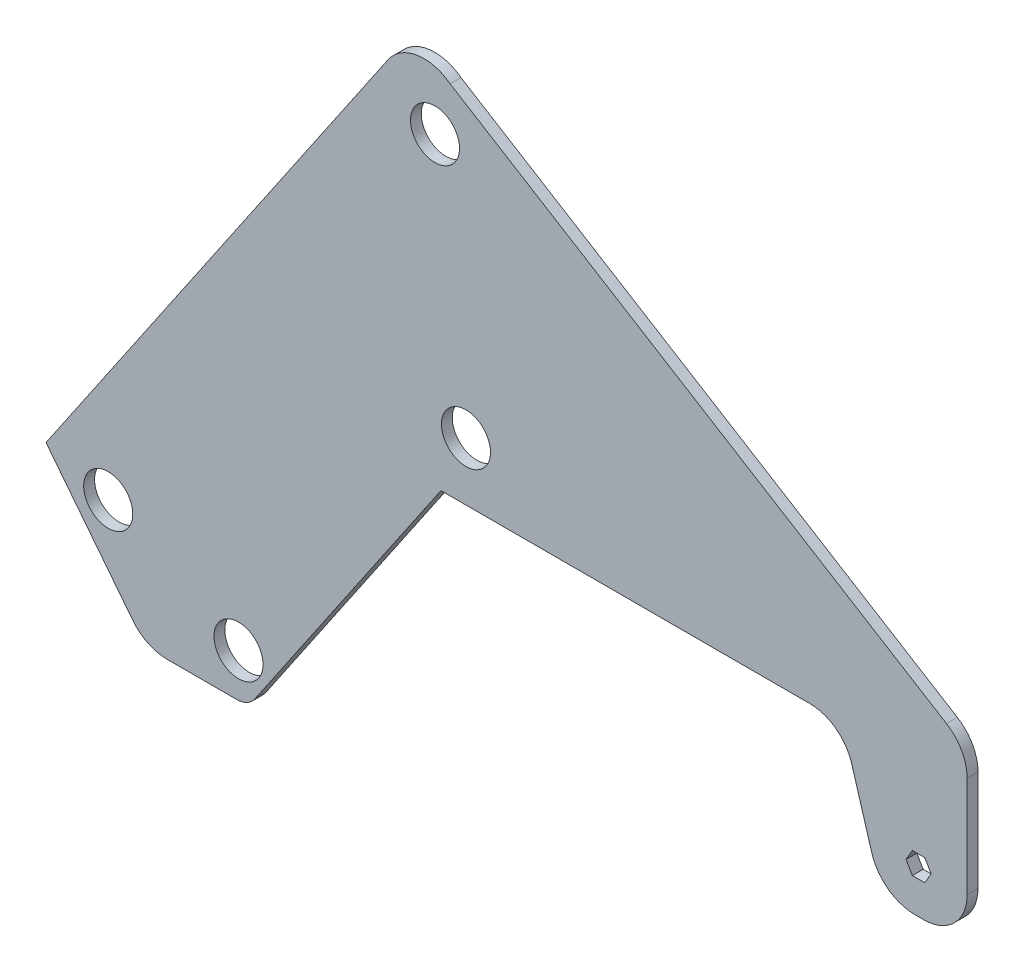
ISO-10303-21;
HEADER;
FILE_DESCRIPTION(('STEP AP214'),'2;1');
FILE_NAME('part.step','',(''),(''),'','','');
FILE_SCHEMA(('AUTOMOTIVE_DESIGN { 1 0 10303 214 1 1 1 1 }'));
ENDSEC;
DATA;
#1=APPLICATION_CONTEXT('core data for automotive mechanical design processes');
#2=APPLICATION_PROTOCOL_DEFINITION('international standard','automotive_design',2000,#1);
#3=PRODUCT_CONTEXT('',#1,'mechanical');
#4=PRODUCT('Part','Part','',(#3));
#5=PRODUCT_RELATED_PRODUCT_CATEGORY('part','',(#4));
#6=PRODUCT_DEFINITION_FORMATION('','',#4);
#7=PRODUCT_DEFINITION_CONTEXT('part definition',#1,'design');
#8=PRODUCT_DEFINITION('design','',#6,#7);
#9=PRODUCT_DEFINITION_SHAPE('','',#8);
#10=(LENGTH_UNIT() NAMED_UNIT(*) SI_UNIT(.MILLI.,.METRE.));
#11=(NAMED_UNIT(*) PLANE_ANGLE_UNIT() SI_UNIT($,.RADIAN.));
#12=(NAMED_UNIT(*) SI_UNIT($,.STERADIAN.) SOLID_ANGLE_UNIT());
#13=UNCERTAINTY_MEASURE_WITH_UNIT(LENGTH_MEASURE(1.E-05),#10,'distance_accuracy_value','');
#14=(GEOMETRIC_REPRESENTATION_CONTEXT(3) GLOBAL_UNCERTAINTY_ASSIGNED_CONTEXT((#13)) GLOBAL_UNIT_ASSIGNED_CONTEXT((#10,
#11,#12)) REPRESENTATION_CONTEXT('',''));
#15=CARTESIAN_POINT('',(0.,0.,0.));
#16=DIRECTION('',(0.,0.,1.));
#17=DIRECTION('',(1.,0.,0.));
#18=AXIS2_PLACEMENT_3D('',#15,#16,#17);
#19=CARTESIAN_POINT('',(102.472108534572,0.,6.35));
#20=DIRECTION('',(-1.,0.,0.));
#21=DIRECTION('',(0.,-1.,0.));
#22=AXIS2_PLACEMENT_3D('',#19,#20,#21);
#23=PLANE('',#22);
#24=DIRECTION('',(0.,1.,0.));
#25=VECTOR('',#24,1.);
#26=CARTESIAN_POINT('',(102.472108534572,0.,0.));
#27=LINE('',#26,#25);
#28=CARTESIAN_POINT('',(102.472108534572,53.8502480160104,0.));
#29=VERTEX_POINT('',#28);
#30=CARTESIAN_POINT('',(102.472108534572,112.853785651262,0.));
#31=VERTEX_POINT('',#30);
#32=EDGE_CURVE('E248',#29,#31,#27,.T.);
#33=ORIENTED_EDGE('',*,*,#32,.T.);
#34=DIRECTION('',(0.,0.,-1.));
#35=VECTOR('',#34,1.);
#36=CARTESIAN_POINT('',(102.472108534572,112.853785651262,6.35));
#37=LINE('',#36,#35);
#38=CARTESIAN_POINT('',(102.472108534572,112.853785651262,6.35));
#39=VERTEX_POINT('',#38);
#40=EDGE_CURVE('E11',#39,#31,#37,.T.);
#41=ORIENTED_EDGE('',*,*,#40,.F.);
#42=DIRECTION('',(0.,1.,0.));
#43=VECTOR('',#42,1.);
#44=CARTESIAN_POINT('',(102.472108534572,0.,6.35));
#45=LINE('',#44,#43);
#46=CARTESIAN_POINT('',(102.472108534572,53.8502480160104,6.35));
#47=VERTEX_POINT('',#46);
#48=EDGE_CURVE('E370',#47,#39,#45,.T.);
#49=ORIENTED_EDGE('',*,*,#48,.F.);
#50=DIRECTION('',(0.,0.,-1.));
#51=VECTOR('',#50,1.);
#52=CARTESIAN_POINT('',(102.472108534572,53.8502480160104,6.35));
#53=LINE('',#52,#51);
#54=EDGE_CURVE('E286',#47,#29,#53,.T.);
#55=ORIENTED_EDGE('',*,*,#54,.T.);
#56=EDGE_LOOP('',(#33,#41,#49,#55));
#57=FACE_BOUND('',#56,.T.);
#58=ADVANCED_FACE('F34',(#57),#23,.F.);
#59=CARTESIAN_POINT('',(77.0721085345722,112.853785651262,6.35));
#60=DIRECTION('',(0.,0.,-1.));
#61=DIRECTION('',(-1.,0.,0.));
#62=AXIS2_PLACEMENT_3D('',#59,#60,#61);
#63=CYLINDRICAL_SURFACE('',#62,25.4);
#64=CARTESIAN_POINT('',(77.0721085345722,112.853785651262,0.));
#65=DIRECTION('',(0.,0.,1.));
#66=DIRECTION('',(1.,0.,0.));
#67=AXIS2_PLACEMENT_3D('',#64,#65,#66);
#68=CIRCLE('',#67,25.4);
#69=CARTESIAN_POINT('',(90.396972478243,134.478031323254,0.));
#70=VERTEX_POINT('',#69);
#71=EDGE_CURVE('E251',#31,#70,#68,.T.);
#72=ORIENTED_EDGE('',*,*,#71,.T.);
#73=DIRECTION('',(0.,0.,-1.));
#74=VECTOR('',#73,1.);
#75=CARTESIAN_POINT('',(90.396972478243,134.478031323254,6.35));
#76=LINE('',#75,#74);
#77=CARTESIAN_POINT('',(90.396972478243,134.478031323254,6.35));
#78=VERTEX_POINT('',#77);
#79=EDGE_CURVE('E44',#78,#70,#76,.T.);
#80=ORIENTED_EDGE('',*,*,#79,.F.);
#81=CARTESIAN_POINT('',(77.0721085345722,112.853785651262,6.35));
#82=DIRECTION('',(0.,0.,1.));
#83=DIRECTION('',(1.,0.,0.));
#84=AXIS2_PLACEMENT_3D('',#81,#82,#83);
#85=CIRCLE('',#84,25.4);
#86=EDGE_CURVE('E372',#39,#78,#85,.T.);
#87=ORIENTED_EDGE('',*,*,#86,.F.);
#88=ORIENTED_EDGE('',*,*,#40,.T.);
#89=EDGE_LOOP('',(#72,#80,#87,#88));
#90=FACE_BOUND('',#89,.T.);
#91=ADVANCED_FACE('F421',(#90),#63,.T.);
#92=CARTESIAN_POINT('',(84.9381251195718,137.841774014995,6.35));
#93=DIRECTION('',(-0.524600942664203,-0.851348254802833,0.));
#94=DIRECTION('',(0.851348254802833,-0.524600942664203,0.));
#95=AXIS2_PLACEMENT_3D('',#92,#93,#94);
#96=PLANE('',#95);
#97=DIRECTION('',(-0.851348254802833,0.524600942664203,0.));
#98=VECTOR('',#97,1.);
#99=CARTESIAN_POINT('',(84.9381251195718,137.841774014995,0.));
#100=LINE('',#99,#98);
#101=CARTESIAN_POINT('',(-199.949582692955,313.389629112798,0.));
#102=VERTEX_POINT('',#101);
#103=EDGE_CURVE('E253',#70,#102,#100,.T.);
#104=ORIENTED_EDGE('',*,*,#103,.T.);
#105=DIRECTION('',(0.,0.,-1.));
#106=VECTOR('',#105,1.);
#107=CARTESIAN_POINT('',(-199.949582692955,313.389629112798,6.35));
#108=LINE('',#107,#106);
#109=CARTESIAN_POINT('',(-199.949582692955,313.389629112798,6.35));
#110=VERTEX_POINT('',#109);
#111=EDGE_CURVE('E312',#110,#102,#108,.T.);
#112=ORIENTED_EDGE('',*,*,#111,.F.);
#113=DIRECTION('',(-0.851348254802833,0.524600942664203,0.));
#114=VECTOR('',#113,1.);
#115=CARTESIAN_POINT('',(84.9381251195718,137.841774014995,6.35));
#116=LINE('',#115,#114);
#117=EDGE_CURVE('E374',#78,#110,#116,.T.);
#118=ORIENTED_EDGE('',*,*,#117,.F.);
#119=ORIENTED_EDGE('',*,*,#79,.T.);
#120=EDGE_LOOP('',(#104,#112,#118,#119));
#121=FACE_BOUND('',#120,.T.);
#122=ADVANCED_FACE('F426',(#121),#96,.F.);
#123=CARTESIAN_POINT('',(-215.304985157272,293.156695189146,6.35));
#124=DIRECTION('',(0.,0.,-1.));
#125=DIRECTION('',(-1.,0.,0.));
#126=AXIS2_PLACEMENT_3D('',#123,#124,#125);
#127=CYLINDRICAL_SURFACE('',#126,25.4);
#128=CARTESIAN_POINT('',(-215.304985157272,293.156695189146,0.));
#129=DIRECTION('',(0.,0.,1.));
#130=DIRECTION('',(1.,0.,0.));
#131=AXIS2_PLACEMENT_3D('',#128,#129,#130);
#132=CIRCLE('',#131,25.4);
#133=CARTESIAN_POINT('',(-236.303247901058,307.447705011511,0.));
#134=VERTEX_POINT('',#133);
#135=EDGE_CURVE('E256',#134,#102,#132,.F.);
#136=ORIENTED_EDGE('',*,*,#135,.F.);
#137=DIRECTION('',(0.,0.,-1.));
#138=VECTOR('',#137,1.);
#139=CARTESIAN_POINT('',(-236.303247901058,307.447705011511,6.35));
#140=LINE('',#139,#138);
#141=CARTESIAN_POINT('',(-236.303247901058,307.447705011511,6.35));
#142=VERTEX_POINT('',#141);
#143=EDGE_CURVE('E310',#142,#134,#140,.T.);
#144=ORIENTED_EDGE('',*,*,#143,.F.);
#145=CARTESIAN_POINT('',(-215.304985157272,293.156695189146,6.35));
#146=DIRECTION('',(0.,0.,1.));
#147=DIRECTION('',(1.,0.,0.));
#148=AXIS2_PLACEMENT_3D('',#145,#146,#147);
#149=CIRCLE('',#148,25.4);
#150=EDGE_CURVE('E376',#142,#110,#149,.F.);
#151=ORIENTED_EDGE('',*,*,#150,.T.);
#152=ORIENTED_EDGE('',*,*,#111,.T.);
#153=EDGE_LOOP('',(#136,#144,#151,#152));
#154=FACE_BOUND('',#153,.T.);
#155=ADVANCED_FACE('F498',(#154),#127,.T.);
#156=CARTESIAN_POINT('',(-304.503316688019,207.239043668924,6.35));
#157=DIRECTION('',(0.82670325762938,-0.562638181982854,0.));
#158=DIRECTION('',(0.562638181982854,0.82670325762938,0.));
#159=AXIS2_PLACEMENT_3D('',#156,#157,#158);
#160=PLANE('',#159);
#161=DIRECTION('',(-0.562638181982854,-0.82670325762938,0.));
#162=VECTOR('',#161,1.);
#163=CARTESIAN_POINT('',(-304.503316688019,207.239043668924,0.));
#164=LINE('',#163,#162);
#165=CARTESIAN_POINT('',(-436.377385414161,13.4720265985031,0.));
#166=VERTEX_POINT('',#165);
#167=EDGE_CURVE('E259',#134,#166,#164,.T.);
#168=ORIENTED_EDGE('',*,*,#167,.T.);
#169=DIRECTION('',(0.,0.,-1.));
#170=VECTOR('',#169,1.);
#171=CARTESIAN_POINT('',(-436.377385414161,13.4720265985031,6.35));
#172=LINE('',#171,#170);
#173=CARTESIAN_POINT('',(-436.377385414161,13.4720265985031,6.35));
#174=VERTEX_POINT('',#173);
#175=EDGE_CURVE('E307',#174,#166,#172,.T.);
#176=ORIENTED_EDGE('',*,*,#175,.F.);
#177=DIRECTION('',(-0.562638181982854,-0.82670325762938,0.));
#178=VECTOR('',#177,1.);
#179=CARTESIAN_POINT('',(-304.503316688019,207.239043668924,6.35));
#180=LINE('',#179,#178);
#181=EDGE_CURVE('E379',#142,#174,#180,.T.);
#182=ORIENTED_EDGE('',*,*,#181,.F.);
#183=ORIENTED_EDGE('',*,*,#143,.T.);
#184=EDGE_LOOP('',(#168,#176,#182,#183));
#185=FACE_BOUND('',#184,.T.);
#186=ADVANCED_FACE('F494',(#185),#160,.F.);
#187=CARTESIAN_POINT('',(-263.347672168998,-206.83445768012,6.35));
#188=DIRECTION('',(0.786436663589847,0.617670927081459,0.));
#189=DIRECTION('',(-0.617670927081459,0.786436663589847,0.));
#190=AXIS2_PLACEMENT_3D('',#187,#188,#189);
#191=PLANE('',#190);
#192=DIRECTION('',(0.617670927081459,-0.786436663589847,0.));
#193=VECTOR('',#192,1.);
#194=CARTESIAN_POINT('',(-263.347672168998,-206.83445768012,0.));
#195=LINE('',#194,#193);
#196=CARTESIAN_POINT('',(-385.58146606046,-51.2028214298151,0.));
#197=VERTEX_POINT('',#196);
#198=EDGE_CURVE('E261',#166,#197,#195,.T.);
#199=ORIENTED_EDGE('',*,*,#198,.T.);
#200=DIRECTION('',(0.,0.,-1.));
#201=VECTOR('',#200,1.);
#202=CARTESIAN_POINT('',(-385.58146606046,-51.2028214298151,6.35));
#203=LINE('',#202,#201);
#204=CARTESIAN_POINT('',(-385.58146606046,-51.2028214298151,6.35));
#205=VERTEX_POINT('',#204);
#206=EDGE_CURVE('E305',#205,#197,#203,.T.);
#207=ORIENTED_EDGE('',*,*,#206,.F.);
#208=DIRECTION('',(0.617670927081459,-0.786436663589847,0.));
#209=VECTOR('',#208,1.);
#210=CARTESIAN_POINT('',(-263.347672168998,-206.83445768012,6.35));
#211=LINE('',#210,#209);
#212=EDGE_CURVE('E381',#174,#205,#211,.T.);
#213=ORIENTED_EDGE('',*,*,#212,.F.);
#214=ORIENTED_EDGE('',*,*,#175,.T.);
#215=EDGE_LOOP('',(#199,#207,#213,#214));
#216=FACE_BOUND('',#215,.T.);
#217=ADVANCED_FACE('F490',(#216),#191,.F.);
#218=CARTESIAN_POINT('',(-365.605974805278,-35.513979881946,6.35));
#219=DIRECTION('',(0.,0.,-1.));
#220=DIRECTION('',(-1.,0.,0.));
#221=AXIS2_PLACEMENT_3D('',#218,#219,#220);
#222=CYLINDRICAL_SURFACE('',#221,25.3999999999999);
#223=CARTESIAN_POINT('',(-365.605974805278,-35.513979881946,0.));
#224=DIRECTION('',(0.,0.,1.));
#225=DIRECTION('',(1.,0.,0.));
#226=AXIS2_PLACEMENT_3D('',#223,#224,#225);
#227=CIRCLE('',#226,25.3999999999999);
#228=CARTESIAN_POINT('',(-365.605974805278,-60.913979881946,0.));
#229=VERTEX_POINT('',#228);
#230=EDGE_CURVE('E264',#229,#197,#227,.F.);
#231=ORIENTED_EDGE('',*,*,#230,.F.);
#232=DIRECTION('',(0.,0.,-1.));
#233=VECTOR('',#232,1.);
#234=CARTESIAN_POINT('',(-365.605974805278,-60.913979881946,6.35));
#235=LINE('',#234,#233);
#236=CARTESIAN_POINT('',(-365.605974805278,-60.913979881946,6.35));
#237=VERTEX_POINT('',#236);
#238=EDGE_CURVE('E303',#237,#229,#235,.T.);
#239=ORIENTED_EDGE('',*,*,#238,.F.);
#240=CARTESIAN_POINT('',(-365.605974805278,-35.513979881946,6.35));
#241=DIRECTION('',(0.,0.,1.));
#242=DIRECTION('',(1.,0.,0.));
#243=AXIS2_PLACEMENT_3D('',#240,#241,#242);
#244=CIRCLE('',#243,25.3999999999999);
#245=EDGE_CURVE('E383',#237,#205,#244,.F.);
#246=ORIENTED_EDGE('',*,*,#245,.T.);
#247=ORIENTED_EDGE('',*,*,#206,.T.);
#248=EDGE_LOOP('',(#231,#239,#246,#247));
#249=FACE_BOUND('',#248,.T.);
#250=ADVANCED_FACE('F486',(#249),#222,.T.);
#251=CARTESIAN_POINT('',(0.,-60.913979881946,6.35));
#252=DIRECTION('',(0.,1.,0.));
#253=DIRECTION('',(0.,0.,1.));
#254=AXIS2_PLACEMENT_3D('',#251,#252,#253);
#255=PLANE('',#254);
#256=DIRECTION('',(1.,0.,0.));
#257=VECTOR('',#256,1.);
#258=CARTESIAN_POINT('',(0.,-60.913979881946,0.));
#259=LINE('',#258,#257);
#260=CARTESIAN_POINT('',(-324.737451002008,-60.913979881946,0.));
#261=VERTEX_POINT('',#260);
#262=EDGE_CURVE('E267',#229,#261,#259,.T.);
#263=ORIENTED_EDGE('',*,*,#262,.T.);
#264=DIRECTION('',(0.,0.,-1.));
#265=VECTOR('',#264,1.);
#266=CARTESIAN_POINT('',(-324.737451002008,-60.913979881946,6.35));
#267=LINE('',#266,#265);
#268=CARTESIAN_POINT('',(-324.737451002008,-60.913979881946,6.35));
#269=VERTEX_POINT('',#268);
#270=EDGE_CURVE('E300',#269,#261,#267,.T.);
#271=ORIENTED_EDGE('',*,*,#270,.F.);
#272=DIRECTION('',(1.,0.,0.));
#273=VECTOR('',#272,1.);
#274=CARTESIAN_POINT('',(0.,-60.913979881946,6.35));
#275=LINE('',#274,#273);
#276=EDGE_CURVE('E386',#237,#269,#275,.T.);
#277=ORIENTED_EDGE('',*,*,#276,.F.);
#278=ORIENTED_EDGE('',*,*,#238,.T.);
#279=EDGE_LOOP('',(#263,#271,#277,#278));
#280=FACE_BOUND('',#279,.T.);
#281=ADVANCED_FACE('F482',(#280),#255,.F.);
#282=CARTESIAN_POINT('',(-324.737451002008,-48.213979881946,6.35));
#283=DIRECTION('',(0.,0.,-1.));
#284=DIRECTION('',(-1.,0.,0.));
#285=AXIS2_PLACEMENT_3D('',#282,#283,#284);
#286=CYLINDRICAL_SURFACE('',#285,12.7);
#287=CARTESIAN_POINT('',(-324.737451002008,-48.213979881946,0.));
#288=DIRECTION('',(0.,0.,1.));
#289=DIRECTION('',(1.,0.,0.));
#290=AXIS2_PLACEMENT_3D('',#287,#288,#289);
#291=CIRCLE('',#290,12.7);
#292=CARTESIAN_POINT('',(-314.238319630114,-55.3594847931282,0.));
#293=VERTEX_POINT('',#292);
#294=EDGE_CURVE('E269',#261,#293,#291,.T.);
#295=ORIENTED_EDGE('',*,*,#294,.T.);
#296=DIRECTION('',(0.,0.,-1.));
#297=VECTOR('',#296,1.);
#298=CARTESIAN_POINT('',(-314.238319630114,-55.3594847931282,6.35));
#299=LINE('',#298,#297);
#300=CARTESIAN_POINT('',(-314.238319630114,-55.3594847931282,6.35));
#301=VERTEX_POINT('',#300);
#302=EDGE_CURVE('E297',#301,#293,#299,.T.);
#303=ORIENTED_EDGE('',*,*,#302,.F.);
#304=CARTESIAN_POINT('',(-324.737451002008,-48.213979881946,6.35));
#305=DIRECTION('',(0.,0.,1.));
#306=DIRECTION('',(1.,0.,0.));
#307=AXIS2_PLACEMENT_3D('',#304,#305,#306);
#308=CIRCLE('',#307,12.7);
#309=EDGE_CURVE('E388',#269,#301,#308,.T.);
#310=ORIENTED_EDGE('',*,*,#309,.F.);
#311=ORIENTED_EDGE('',*,*,#270,.T.);
#312=EDGE_LOOP('',(#295,#303,#310,#311));
#313=FACE_BOUND('',#312,.T.);
#314=ADVANCED_FACE('F478',(#313),#286,.T.);
#315=CARTESIAN_POINT('',(-189.012871597195,128.638489645919,6.35));
#316=DIRECTION('',(-0.82670325762938,0.562638181982854,0.));
#317=DIRECTION('',(-0.562638181982854,-0.82670325762938,0.));
#318=AXIS2_PLACEMENT_3D('',#315,#316,#317);
#319=PLANE('',#318);
#320=DIRECTION('',(0.562638181982854,0.82670325762938,0.));
#321=VECTOR('',#320,1.);
#322=CARTESIAN_POINT('',(-189.012871597195,128.638489645919,0.));
#323=LINE('',#322,#321);
#324=CARTESIAN_POINT('',(-205.338802981958,104.65024801601,0.));
#325=VERTEX_POINT('',#324);
#326=EDGE_CURVE('E271',#293,#325,#323,.T.);
#327=ORIENTED_EDGE('',*,*,#326,.T.);
#328=DIRECTION('',(0.,0.,-1.));
#329=VECTOR('',#328,1.);
#330=CARTESIAN_POINT('',(-205.338802981958,104.65024801601,6.35));
#331=LINE('',#330,#329);
#332=CARTESIAN_POINT('',(-205.338802981958,104.65024801601,6.35));
#333=VERTEX_POINT('',#332);
#334=EDGE_CURVE('E294',#333,#325,#331,.T.);
#335=ORIENTED_EDGE('',*,*,#334,.F.);
#336=DIRECTION('',(0.562638181982854,0.82670325762938,0.));
#337=VECTOR('',#336,1.);
#338=CARTESIAN_POINT('',(-189.012871597195,128.638489645919,6.35));
#339=LINE('',#338,#337);
#340=EDGE_CURVE('E390',#301,#333,#339,.T.);
#341=ORIENTED_EDGE('',*,*,#340,.F.);
#342=ORIENTED_EDGE('',*,*,#302,.T.);
#343=EDGE_LOOP('',(#327,#335,#341,#342));
#344=FACE_BOUND('',#343,.T.);
#345=ADVANCED_FACE('F474',(#344),#319,.F.);
#346=CARTESIAN_POINT('',(0.,104.65024801601,6.35));
#347=DIRECTION('',(0.,1.,0.));
#348=DIRECTION('',(0.,0.,1.));
#349=AXIS2_PLACEMENT_3D('',#346,#347,#348);
#350=PLANE('',#349);
#351=DIRECTION('',(1.,0.,0.));
#352=VECTOR('',#351,1.);
#353=CARTESIAN_POINT('',(0.,104.65024801601,0.));
#354=LINE('',#353,#352);
#355=CARTESIAN_POINT('',(10.5611970180423,104.65024801601,0.));
#356=VERTEX_POINT('',#355);
#357=EDGE_CURVE('E273',#325,#356,#354,.T.);
#358=ORIENTED_EDGE('',*,*,#357,.T.);
#359=DIRECTION('',(0.,0.,-1.));
#360=VECTOR('',#359,1.);
#361=CARTESIAN_POINT('',(10.5611970180423,104.65024801601,6.35));
#362=LINE('',#361,#360);
#363=CARTESIAN_POINT('',(10.5611970180423,104.65024801601,6.35));
#364=VERTEX_POINT('',#363);
#365=EDGE_CURVE('E292',#364,#356,#362,.T.);
#366=ORIENTED_EDGE('',*,*,#365,.F.);
#367=DIRECTION('',(1.,0.,0.));
#368=VECTOR('',#367,1.);
#369=CARTESIAN_POINT('',(0.,104.65024801601,6.35));
#370=LINE('',#369,#368);
#371=EDGE_CURVE('E392',#333,#364,#370,.T.);
#372=ORIENTED_EDGE('',*,*,#371,.F.);
#373=ORIENTED_EDGE('',*,*,#334,.T.);
#374=EDGE_LOOP('',(#358,#366,#372,#373));
#375=FACE_BOUND('',#374,.T.);
#376=ADVANCED_FACE('F470',(#375),#350,.F.);
#377=CARTESIAN_POINT('',(10.5611970180423,79.2502480160104,6.35));
#378=DIRECTION('',(0.,0.,-1.));
#379=DIRECTION('',(-1.,0.,0.));
#380=AXIS2_PLACEMENT_3D('',#377,#378,#379);
#381=CYLINDRICAL_SURFACE('',#380,25.4);
#382=CARTESIAN_POINT('',(10.5611970180423,79.2502480160104,0.));
#383=DIRECTION('',(0.,0.,1.));
#384=DIRECTION('',(1.,0.,0.));
#385=AXIS2_PLACEMENT_3D('',#382,#383,#384);
#386=CIRCLE('',#385,25.4);
#387=CARTESIAN_POINT('',(34.8921218252118,86.54175664097,0.));
#388=VERTEX_POINT('',#387);
#389=EDGE_CURVE('E276',#388,#356,#386,.T.);
#390=ORIENTED_EDGE('',*,*,#389,.F.);
#391=DIRECTION('',(0.,0.,-1.));
#392=VECTOR('',#391,1.);
#393=CARTESIAN_POINT('',(34.8921218252118,86.54175664097,6.35));
#394=LINE('',#393,#392);
#395=CARTESIAN_POINT('',(34.8921218252118,86.54175664097,6.35));
#396=VERTEX_POINT('',#395);
#397=EDGE_CURVE('E290',#396,#388,#394,.T.);
#398=ORIENTED_EDGE('',*,*,#397,.F.);
#399=CARTESIAN_POINT('',(10.5611970180423,79.2502480160104,6.35));
#400=DIRECTION('',(0.,0.,1.));
#401=DIRECTION('',(1.,0.,0.));
#402=AXIS2_PLACEMENT_3D('',#399,#400,#401);
#403=CIRCLE('',#402,25.4);
#404=EDGE_CURVE('E394',#396,#364,#403,.T.);
#405=ORIENTED_EDGE('',*,*,#404,.T.);
#406=ORIENTED_EDGE('',*,*,#365,.T.);
#407=EDGE_LOOP('',(#390,#398,#405,#406));
#408=FACE_BOUND('',#407,.T.);
#409=ADVANCED_FACE('F467',(#408),#381,.F.);
#410=CARTESIAN_POINT('',(55.814406762391,16.7265005966835,6.35));
#411=DIRECTION('',(-0.957910425479116,-0.2870672686992,0.));
#412=DIRECTION('',(0.2870672686992,-0.957910425479116,0.));
#413=AXIS2_PLACEMENT_3D('',#410,#411,#412);
#414=PLANE('',#413);
#415=DIRECTION('',(-0.2870672686992,0.957910425479116,0.));
#416=VECTOR('',#415,1.);
#417=CARTESIAN_POINT('',(55.814406762391,16.7265005966835,0.));
#418=LINE('',#417,#416);
#419=CARTESIAN_POINT('',(46.5921085345722,47.5002480160104,0.));
#420=VERTEX_POINT('',#419);
#421=EDGE_CURVE('E279',#420,#388,#418,.T.);
#422=ORIENTED_EDGE('',*,*,#421,.F.);
#423=DIRECTION('',(0.,0.,-1.));
#424=VECTOR('',#423,1.);
#425=CARTESIAN_POINT('',(46.5921085345722,47.5002480160104,6.35));
#426=LINE('',#425,#424);
#427=CARTESIAN_POINT('',(46.5921085345722,47.5002480160104,6.35));
#428=VERTEX_POINT('',#427);
#429=EDGE_CURVE('E209',#428,#420,#426,.T.);
#430=ORIENTED_EDGE('',*,*,#429,.F.);
#431=DIRECTION('',(-0.2870672686992,0.957910425479116,0.));
#432=VECTOR('',#431,1.);
#433=CARTESIAN_POINT('',(55.814406762391,16.7265005966835,6.35));
#434=LINE('',#433,#432);
#435=EDGE_CURVE('E202',#428,#396,#434,.T.);
#436=ORIENTED_EDGE('',*,*,#435,.T.);
#437=ORIENTED_EDGE('',*,*,#397,.T.);
#438=EDGE_LOOP('',(#422,#430,#436,#437));
#439=FACE_BOUND('',#438,.T.);
#440=ADVANCED_FACE('F398',(#439),#414,.T.);
#441=CARTESIAN_POINT('',(71.8831488401451,54.7636133634674,6.35));
#442=DIRECTION('',(0.,0.,-1.));
#443=DIRECTION('',(-1.,0.,0.));
#444=AXIS2_PLACEMENT_3D('',#441,#442,#443);
#445=CYLINDRICAL_SURFACE('',#444,26.313365347457);
#446=CARTESIAN_POINT('',(71.8831488401451,54.7636133634674,0.));
#447=DIRECTION('',(0.,0.,1.));
#448=DIRECTION('',(1.,0.,0.));
#449=AXIS2_PLACEMENT_3D('',#446,#447,#448);
#450=CIRCLE('',#449,26.313365347457);
#451=CARTESIAN_POINT('',(71.8831488401451,28.4502480160104,0.));
#452=VERTEX_POINT('',#451);
#453=EDGE_CURVE('E208',#420,#452,#450,.T.);
#454=ORIENTED_EDGE('',*,*,#453,.T.);
#455=DIRECTION('',(0.,0.,-1.));
#456=VECTOR('',#455,1.);
#457=CARTESIAN_POINT('',(71.8831488401451,28.4502480160104,6.35));
#458=LINE('',#457,#456);
#459=CARTESIAN_POINT('',(71.8831488401451,28.4502480160104,6.35));
#460=VERTEX_POINT('',#459);
#461=EDGE_CURVE('E205',#460,#452,#458,.T.);
#462=ORIENTED_EDGE('',*,*,#461,.F.);
#463=CARTESIAN_POINT('',(71.8831488401451,54.7636133634674,6.35));
#464=DIRECTION('',(0.,0.,1.));
#465=DIRECTION('',(1.,0.,0.));
#466=AXIS2_PLACEMENT_3D('',#463,#464,#465);
#467=CIRCLE('',#466,26.313365347457);
#468=EDGE_CURVE('E195',#428,#460,#467,.T.);
#469=ORIENTED_EDGE('',*,*,#468,.F.);
#470=ORIENTED_EDGE('',*,*,#429,.T.);
#471=EDGE_LOOP('',(#454,#462,#469,#470));
#472=FACE_BOUND('',#471,.T.);
#473=ADVANCED_FACE('F206',(#472),#445,.T.);
#474=CARTESIAN_POINT('',(0.,28.4502480160104,6.35));
#475=DIRECTION('',(0.,1.,0.));
#476=DIRECTION('',(0.,0.,1.));
#477=AXIS2_PLACEMENT_3D('',#474,#475,#476);
#478=PLANE('',#477);
#479=DIRECTION('',(1.,0.,0.));
#480=VECTOR('',#479,1.);
#481=CARTESIAN_POINT('',(0.,28.4502480160104,0.));
#482=LINE('',#481,#480);
#483=CARTESIAN_POINT('',(77.0721085345723,28.4502480160104,0.));
#484=VERTEX_POINT('',#483);
#485=EDGE_CURVE('E124',#452,#484,#482,.T.);
#486=ORIENTED_EDGE('',*,*,#485,.T.);
#487=DIRECTION('',(0.,0.,-1.));
#488=VECTOR('',#487,1.);
#489=CARTESIAN_POINT('',(77.0721085345723,28.4502480160104,6.35));
#490=LINE('',#489,#488);
#491=CARTESIAN_POINT('',(77.0721085345723,28.4502480160104,6.35));
#492=VERTEX_POINT('',#491);
#493=EDGE_CURVE('E210',#492,#484,#490,.T.);
#494=ORIENTED_EDGE('',*,*,#493,.F.);
#495=DIRECTION('',(1.,0.,0.));
#496=VECTOR('',#495,1.);
#497=CARTESIAN_POINT('',(0.,28.4502480160104,6.35));
#498=LINE('',#497,#496);
#499=EDGE_CURVE('E199',#460,#492,#498,.T.);
#500=ORIENTED_EDGE('',*,*,#499,.F.);
#501=ORIENTED_EDGE('',*,*,#461,.T.);
#502=EDGE_LOOP('',(#486,#494,#500,#501));
#503=FACE_BOUND('',#502,.T.);
#504=ADVANCED_FACE('F212',(#503),#478,.F.);
#505=CARTESIAN_POINT('',(37.7273176865842,-21.7818770221519,6.35));
#506=DIRECTION('',(-0.866025403784439,0.499999999999999,0.));
#507=DIRECTION('',(-0.499999999999999,-0.866025403784439,0.));
#508=AXIS2_PLACEMENT_3D('',#505,#506,#507);
#509=PLANE('',#508);
#510=DIRECTION('',(0.499999999999999,0.866025403784439,0.));
#511=VECTOR('',#510,1.);
#512=CARTESIAN_POINT('',(37.7273176865842,-21.7818770221519,0.));
#513=LINE('',#512,#511);
#514=CARTESIAN_POINT('',(77.7273712273964,47.5002480160104,0.));
#515=VERTEX_POINT('',#514);
#516=CARTESIAN_POINT('',(81.3935454367506,53.8502480160103,0.));
#517=VERTEX_POINT('',#516);
#518=EDGE_CURVE('E218',#515,#517,#513,.T.);
#519=ORIENTED_EDGE('',*,*,#518,.F.);
#520=DIRECTION('',(0.,0.,-1.));
#521=VECTOR('',#520,1.);
#522=CARTESIAN_POINT('',(77.7273712273964,47.5002480160104,6.35));
#523=LINE('',#522,#521);
#524=CARTESIAN_POINT('',(77.7273712273964,47.5002480160104,6.35));
#525=VERTEX_POINT('',#524);
#526=EDGE_CURVE('E38',#525,#515,#523,.T.);
#527=ORIENTED_EDGE('',*,*,#526,.F.);
#528=DIRECTION('',(0.499999999999999,0.866025403784439,0.));
#529=VECTOR('',#528,1.);
#530=CARTESIAN_POINT('',(37.7273176865842,-21.7818770221519,6.35));
#531=LINE('',#530,#529);
#532=CARTESIAN_POINT('',(81.3935454367506,53.8502480160103,6.35));
#533=VERTEX_POINT('',#532);
#534=EDGE_CURVE('E285',#525,#533,#531,.T.);
#535=ORIENTED_EDGE('',*,*,#534,.T.);
#536=DIRECTION('',(0.,0.,-1.));
#537=VECTOR('',#536,1.);
#538=CARTESIAN_POINT('',(81.3935454367506,53.8502480160103,6.35));
#539=LINE('',#538,#537);
#540=EDGE_CURVE('E214',#533,#517,#539,.T.);
#541=ORIENTED_EDGE('',*,*,#540,.T.);
#542=EDGE_LOOP('',(#519,#527,#535,#541));
#543=FACE_BOUND('',#542,.T.);
#544=ADVANCED_FACE('F36',(#543),#509,.T.);
#545=CARTESIAN_POINT('',(0.,47.5002480160104,6.35));
#546=DIRECTION('',(0.,1.,0.));
#547=DIRECTION('',(0.,0.,1.));
#548=AXIS2_PLACEMENT_3D('',#545,#546,#547);
#549=PLANE('',#548);
#550=DIRECTION('',(1.,0.,0.));
#551=VECTOR('',#550,1.);
#552=CARTESIAN_POINT('',(0.,47.5002480160104,0.));
#553=LINE('',#552,#551);
#554=CARTESIAN_POINT('',(70.3950228086882,47.5002480160104,0.));
#555=VERTEX_POINT('',#554);
#556=EDGE_CURVE('E221',#555,#515,#553,.T.);
#557=ORIENTED_EDGE('',*,*,#556,.F.);
#558=DIRECTION('',(0.,0.,-1.));
#559=VECTOR('',#558,1.);
#560=CARTESIAN_POINT('',(70.3950228086882,47.5002480160104,6.35));
#561=LINE('',#560,#559);
#562=CARTESIAN_POINT('',(70.3950228086882,47.5002480160104,6.35));
#563=VERTEX_POINT('',#562);
#564=EDGE_CURVE('E322',#563,#555,#561,.T.);
#565=ORIENTED_EDGE('',*,*,#564,.F.);
#566=DIRECTION('',(1.,0.,0.));
#567=VECTOR('',#566,1.);
#568=CARTESIAN_POINT('',(0.,47.5002480160104,6.35));
#569=LINE('',#568,#567);
#570=EDGE_CURVE('E331',#563,#525,#569,.T.);
#571=ORIENTED_EDGE('',*,*,#570,.T.);
#572=ORIENTED_EDGE('',*,*,#526,.T.);
#573=EDGE_LOOP('',(#557,#565,#571,#572));
#574=FACE_BOUND('',#573,.T.);
#575=ADVANCED_FACE('F329',(#574),#549,.T.);
#576=CARTESIAN_POINT('',(73.3644778404793,42.3570010301571,6.35));
#577=DIRECTION('',(0.866025403784438,0.500000000000001,0.));
#578=DIRECTION('',(-0.500000000000001,0.866025403784438,0.));
#579=AXIS2_PLACEMENT_3D('',#576,#577,#578);
#580=PLANE('',#579);
#581=DIRECTION('',(0.500000000000001,-0.866025403784438,0.));
#582=VECTOR('',#581,1.);
#583=CARTESIAN_POINT('',(73.3644778404793,42.3570010301571,0.));
#584=LINE('',#583,#582);
#585=CARTESIAN_POINT('',(66.728848599334,53.8502480160104,0.));
#586=VERTEX_POINT('',#585);
#587=EDGE_CURVE('E224',#586,#555,#584,.T.);
#588=ORIENTED_EDGE('',*,*,#587,.F.);
#589=DIRECTION('',(0.,0.,-1.));
#590=VECTOR('',#589,1.);
#591=CARTESIAN_POINT('',(66.728848599334,53.8502480160104,6.35));
#592=LINE('',#591,#590);
#593=CARTESIAN_POINT('',(66.728848599334,53.8502480160104,6.35));
#594=VERTEX_POINT('',#593);
#595=EDGE_CURVE('E321',#594,#586,#592,.T.);
#596=ORIENTED_EDGE('',*,*,#595,.F.);
#597=DIRECTION('',(0.500000000000001,-0.866025403784438,0.));
#598=VECTOR('',#597,1.);
#599=CARTESIAN_POINT('',(73.3644778404793,42.3570010301571,6.35));
#600=LINE('',#599,#598);
#601=EDGE_CURVE('E339',#594,#563,#600,.T.);
#602=ORIENTED_EDGE('',*,*,#601,.T.);
#603=ORIENTED_EDGE('',*,*,#564,.T.);
#604=EDGE_LOOP('',(#588,#596,#602,#603));
#605=FACE_BOUND('',#604,.T.);
#606=ADVANCED_FACE('F337',(#605),#580,.T.);
#607=CARTESIAN_POINT('',(26.7287950585217,-15.4318770221519,6.35));
#608=DIRECTION('',(0.866025403784439,-0.5,0.));
#609=DIRECTION('',(0.5,0.866025403784439,0.));
#610=AXIS2_PLACEMENT_3D('',#607,#608,#609);
#611=PLANE('',#610);
#612=DIRECTION('',(-0.5,-0.866025403784439,0.));
#613=VECTOR('',#612,1.);
#614=CARTESIAN_POINT('',(26.7287950585217,-15.4318770221519,0.));
#615=LINE('',#614,#613);
#616=CARTESIAN_POINT('',(70.3950228086882,60.2002480160104,0.));
#617=VERTEX_POINT('',#616);
#618=EDGE_CURVE('E227',#617,#586,#615,.T.);
#619=ORIENTED_EDGE('',*,*,#618,.F.);
#620=DIRECTION('',(0.,0.,-1.));
#621=VECTOR('',#620,1.);
#622=CARTESIAN_POINT('',(70.3950228086882,60.2002480160104,6.35));
#623=LINE('',#622,#621);
#624=CARTESIAN_POINT('',(70.3950228086882,60.2002480160104,6.35));
#625=VERTEX_POINT('',#624);
#626=EDGE_CURVE('E319',#625,#617,#623,.T.);
#627=ORIENTED_EDGE('',*,*,#626,.F.);
#628=DIRECTION('',(-0.5,-0.866025403784439,0.));
#629=VECTOR('',#628,1.);
#630=CARTESIAN_POINT('',(26.7287950585217,-15.4318770221519,6.35));
#631=LINE('',#630,#629);
#632=EDGE_CURVE('E346',#625,#594,#631,.T.);
#633=ORIENTED_EDGE('',*,*,#632,.T.);
#634=ORIENTED_EDGE('',*,*,#595,.T.);
#635=EDGE_LOOP('',(#619,#627,#633,#634));
#636=FACE_BOUND('',#635,.T.);
#637=ADVANCED_FACE('F349',(#636),#611,.T.);
#638=CARTESIAN_POINT('',(0.,60.2002480160104,6.35));
#639=DIRECTION('',(0.,-1.,0.));
#640=DIRECTION('',(0.,0.,-1.));
#641=AXIS2_PLACEMENT_3D('',#638,#639,#640);
#642=PLANE('',#641);
#643=DIRECTION('',(-1.,0.,0.));
#644=VECTOR('',#643,1.);
#645=CARTESIAN_POINT('',(0.,60.2002480160104,0.));
#646=LINE('',#645,#644);
#647=CARTESIAN_POINT('',(77.7273712273964,60.2002480160104,0.));
#648=VERTEX_POINT('',#647);
#649=EDGE_CURVE('E230',#648,#617,#646,.T.);
#650=ORIENTED_EDGE('',*,*,#649,.F.);
#651=DIRECTION('',(0.,0.,-1.));
#652=VECTOR('',#651,1.);
#653=CARTESIAN_POINT('',(77.7273712273964,60.2002480160104,6.35));
#654=LINE('',#653,#652);
#655=CARTESIAN_POINT('',(77.7273712273964,60.2002480160104,6.35));
#656=VERTEX_POINT('',#655);
#657=EDGE_CURVE('E317',#656,#648,#654,.T.);
#658=ORIENTED_EDGE('',*,*,#657,.F.);
#659=DIRECTION('',(-1.,0.,0.));
#660=VECTOR('',#659,1.);
#661=CARTESIAN_POINT('',(0.,60.2002480160104,6.35));
#662=LINE('',#661,#660);
#663=EDGE_CURVE('E350',#656,#625,#662,.T.);
#664=ORIENTED_EDGE('',*,*,#663,.T.);
#665=ORIENTED_EDGE('',*,*,#626,.T.);
#666=EDGE_LOOP('',(#650,#658,#664,#665));
#667=FACE_BOUND('',#666,.T.);
#668=ADVANCED_FACE('F435',(#667),#642,.T.);
#669=CARTESIAN_POINT('',(-208.832932892682,283.437784316195,6.35));
#670=DIRECTION('',(0.,0.,-1.));
#671=DIRECTION('',(-1.,0.,0.));
#672=AXIS2_PLACEMENT_3D('',#669,#670,#671);
#673=CYLINDRICAL_SURFACE('',#672,14.351);
#674=CARTESIAN_POINT('',(-208.832932892682,283.437784316195,6.35));
#675=DIRECTION('',(0.,0.,1.));
#676=DIRECTION('',(1.,0.,0.));
#677=AXIS2_PLACEMENT_3D('',#674,#675,#676);
#678=CIRCLE('',#677,14.351);
#679=CARTESIAN_POINT('',(-194.481932892682,283.437784316195,6.35));
#680=VERTEX_POINT('',#679);
#681=EDGE_CURVE('E367',#680,#680,#678,.T.);
#682=ORIENTED_EDGE('',*,*,#681,.T.);
#683=EDGE_LOOP('',(#682));
#684=FACE_BOUND('',#683,.T.);
#685=CARTESIAN_POINT('',(-208.832932892682,283.437784316195,0.));
#686=DIRECTION('',(0.,0.,1.));
#687=DIRECTION('',(1.,0.,0.));
#688=AXIS2_PLACEMENT_3D('',#685,#686,#687);
#689=CIRCLE('',#688,14.351);
#690=CARTESIAN_POINT('',(-194.481932892682,283.437784316195,0.));
#691=VERTEX_POINT('',#690);
#692=EDGE_CURVE('E245',#691,#691,#689,.T.);
#693=ORIENTED_EDGE('',*,*,#692,.F.);
#694=EDGE_LOOP('',(#693));
#695=FACE_BOUND('',#694,.T.);
#696=ADVANCED_FACE('F431',(#684,#695),#673,.F.);
#697=CARTESIAN_POINT('',(-190.707148918882,138.516914682677,6.35));
#698=DIRECTION('',(0.,0.,-1.));
#699=DIRECTION('',(-1.,0.,0.));
#700=AXIS2_PLACEMENT_3D('',#697,#698,#699);
#701=CYLINDRICAL_SURFACE('',#700,14.351);
#702=CARTESIAN_POINT('',(-190.707148918882,138.516914682677,6.35));
#703=DIRECTION('',(0.,0.,1.));
#704=DIRECTION('',(1.,0.,0.));
#705=AXIS2_PLACEMENT_3D('',#702,#703,#704);
#706=CIRCLE('',#705,14.351);
#707=CARTESIAN_POINT('',(-176.356148918882,138.516914682677,6.35));
#708=VERTEX_POINT('',#707);
#709=EDGE_CURVE('E364',#708,#708,#706,.T.);
#710=ORIENTED_EDGE('',*,*,#709,.T.);
#711=EDGE_LOOP('',(#710));
#712=FACE_BOUND('',#711,.T.);
#713=CARTESIAN_POINT('',(-190.707148918882,138.516914682677,0.));
#714=DIRECTION('',(0.,0.,1.));
#715=DIRECTION('',(1.,0.,0.));
#716=AXIS2_PLACEMENT_3D('',#713,#714,#715);
#717=CIRCLE('',#716,14.351);
#718=CARTESIAN_POINT('',(-176.356148918882,138.516914682677,0.));
#719=VERTEX_POINT('',#718);
#720=EDGE_CURVE('E242',#719,#719,#717,.T.);
#721=ORIENTED_EDGE('',*,*,#720,.F.);
#722=EDGE_LOOP('',(#721));
#723=FACE_BOUND('',#722,.T.);
#724=ADVANCED_FACE('F434',(#712,#723),#701,.F.);
#725=CARTESIAN_POINT('',(-399.975189266807,2.58602011805398,6.35));
#726=DIRECTION('',(0.,0.,-1.));
#727=DIRECTION('',(-1.,0.,0.));
#728=AXIS2_PLACEMENT_3D('',#725,#726,#727);
#729=CYLINDRICAL_SURFACE('',#728,14.3510000000909);
#730=CARTESIAN_POINT('',(-399.975189266807,2.58602011805398,6.35));
#731=DIRECTION('',(0.,0.,1.));
#732=DIRECTION('',(1.,0.,0.));
#733=AXIS2_PLACEMENT_3D('',#730,#731,#732);
#734=CIRCLE('',#733,14.3510000000909);
#735=CARTESIAN_POINT('',(-385.624189266716,2.58602011805398,6.35));
#736=VERTEX_POINT('',#735);
#737=EDGE_CURVE('E361',#736,#736,#734,.T.);
#738=ORIENTED_EDGE('',*,*,#737,.T.);
#739=EDGE_LOOP('',(#738));
#740=FACE_BOUND('',#739,.T.);
#741=CARTESIAN_POINT('',(-399.975189266807,2.58602011805398,0.));
#742=DIRECTION('',(0.,0.,1.));
#743=DIRECTION('',(1.,0.,0.));
#744=AXIS2_PLACEMENT_3D('',#741,#742,#743);
#745=CIRCLE('',#744,14.3510000000909);
#746=CARTESIAN_POINT('',(-385.624189266716,2.58602011805398,0.));
#747=VERTEX_POINT('',#746);
#748=EDGE_CURVE('E239',#747,#747,#745,.T.);
#749=ORIENTED_EDGE('',*,*,#748,.F.);
#750=EDGE_LOOP('',(#749));
#751=FACE_BOUND('',#750,.T.);
#752=ADVANCED_FACE('F439',(#740,#751),#729,.F.);
#753=CARTESIAN_POINT('',(-323.775189266807,-35.513979881946,6.35));
#754=DIRECTION('',(0.,0.,-1.));
#755=DIRECTION('',(-1.,0.,0.));
#756=AXIS2_PLACEMENT_3D('',#753,#754,#755);
#757=CYLINDRICAL_SURFACE('',#756,14.3509999999554);
#758=CARTESIAN_POINT('',(-323.775189266807,-35.513979881946,6.35));
#759=DIRECTION('',(0.,0.,1.));
#760=DIRECTION('',(1.,0.,0.));
#761=AXIS2_PLACEMENT_3D('',#758,#759,#760);
#762=CIRCLE('',#761,14.3509999999554);
#763=CARTESIAN_POINT('',(-309.424189266852,-35.513979881946,6.35));
#764=VERTEX_POINT('',#763);
#765=EDGE_CURVE('E358',#764,#764,#762,.T.);
#766=ORIENTED_EDGE('',*,*,#765,.T.);
#767=EDGE_LOOP('',(#766));
#768=FACE_BOUND('',#767,.T.);
#769=CARTESIAN_POINT('',(-323.775189266807,-35.513979881946,0.));
#770=DIRECTION('',(0.,0.,1.));
#771=DIRECTION('',(1.,0.,0.));
#772=AXIS2_PLACEMENT_3D('',#769,#770,#771);
#773=CIRCLE('',#772,14.3509999999554);
#774=CARTESIAN_POINT('',(-309.424189266852,-35.513979881946,0.));
#775=VERTEX_POINT('',#774);
#776=EDGE_CURVE('E236',#775,#775,#773,.T.);
#777=ORIENTED_EDGE('',*,*,#776,.F.);
#778=EDGE_LOOP('',(#777));
#779=FACE_BOUND('',#778,.T.);
#780=ADVANCED_FACE('F415',(#768,#779),#757,.F.);
#781=CARTESIAN_POINT('',(84.3630004685417,48.7070010301571,6.35));
#782=DIRECTION('',(-0.866025403784438,-0.5,0.));
#783=DIRECTION('',(0.5,-0.866025403784438,0.));
#784=AXIS2_PLACEMENT_3D('',#781,#782,#783);
#785=PLANE('',#784);
#786=DIRECTION('',(-0.5,0.866025403784438,0.));
#787=VECTOR('',#786,1.);
#788=CARTESIAN_POINT('',(84.3630004685417,48.7070010301571,0.));
#789=LINE('',#788,#787);
#790=EDGE_CURVE('E233',#517,#648,#789,.T.);
#791=ORIENTED_EDGE('',*,*,#790,.F.);
#792=ORIENTED_EDGE('',*,*,#540,.F.);
#793=DIRECTION('',(-0.5,0.866025403784438,0.));
#794=VECTOR('',#793,1.);
#795=CARTESIAN_POINT('',(84.3630004685417,48.7070010301571,6.35));
#796=LINE('',#795,#794);
#797=EDGE_CURVE('E352',#533,#656,#796,.T.);
#798=ORIENTED_EDGE('',*,*,#797,.T.);
#799=ORIENTED_EDGE('',*,*,#657,.T.);
#800=EDGE_LOOP('',(#791,#792,#798,#799));
#801=FACE_BOUND('',#800,.T.);
#802=ADVANCED_FACE('F408',(#801),#785,.T.);
#803=CARTESIAN_POINT('',(77.0721085345722,53.8502480160104,6.35));
#804=DIRECTION('',(0.,0.,-1.));
#805=DIRECTION('',(-1.,0.,0.));
#806=AXIS2_PLACEMENT_3D('',#803,#804,#805);
#807=CYLINDRICAL_SURFACE('',#806,25.4);
#808=CARTESIAN_POINT('',(77.0721085345722,53.8502480160104,0.));
#809=DIRECTION('',(0.,0.,1.));
#810=DIRECTION('',(1.,0.,0.));
#811=AXIS2_PLACEMENT_3D('',#808,#809,#810);
#812=CIRCLE('',#811,25.4);
#813=EDGE_CURVE('E130',#484,#29,#812,.T.);
#814=ORIENTED_EDGE('',*,*,#813,.T.);
#815=ORIENTED_EDGE('',*,*,#54,.F.);
#816=CARTESIAN_POINT('',(77.0721085345722,53.8502480160104,6.35));
#817=DIRECTION('',(0.,0.,1.));
#818=DIRECTION('',(1.,0.,0.));
#819=AXIS2_PLACEMENT_3D('',#816,#817,#818);
#820=CIRCLE('',#819,25.4);
#821=EDGE_CURVE('E53',#492,#47,#820,.T.);
#822=ORIENTED_EDGE('',*,*,#821,.F.);
#823=ORIENTED_EDGE('',*,*,#493,.T.);
#824=EDGE_LOOP('',(#814,#815,#822,#823));
#825=FACE_BOUND('',#824,.T.);
#826=ADVANCED_FACE('F406',(#825),#807,.T.);
#827=CARTESIAN_POINT('',(0.,0.,6.35));
#828=DIRECTION('',(0.,0.,1.));
#829=DIRECTION('',(1.,0.,0.));
#830=AXIS2_PLACEMENT_3D('',#827,#828,#829);
#831=PLANE('',#830);
#832=ORIENTED_EDGE('',*,*,#534,.F.);
#833=ORIENTED_EDGE('',*,*,#570,.F.);
#834=ORIENTED_EDGE('',*,*,#601,.F.);
#835=ORIENTED_EDGE('',*,*,#632,.F.);
#836=ORIENTED_EDGE('',*,*,#663,.F.);
#837=ORIENTED_EDGE('',*,*,#797,.F.);
#838=EDGE_LOOP('',(#832,#833,#834,#835,#836,#837));
#839=FACE_BOUND('',#838,.T.);
#840=ORIENTED_EDGE('',*,*,#765,.F.);
#841=EDGE_LOOP('',(#840));
#842=FACE_BOUND('',#841,.T.);
#843=ORIENTED_EDGE('',*,*,#737,.F.);
#844=EDGE_LOOP('',(#843));
#845=FACE_BOUND('',#844,.T.);
#846=ORIENTED_EDGE('',*,*,#709,.F.);
#847=EDGE_LOOP('',(#846));
#848=FACE_BOUND('',#847,.T.);
#849=ORIENTED_EDGE('',*,*,#681,.F.);
#850=EDGE_LOOP('',(#849));
#851=FACE_BOUND('',#850,.T.);
#852=ORIENTED_EDGE('',*,*,#48,.T.);
#853=ORIENTED_EDGE('',*,*,#86,.T.);
#854=ORIENTED_EDGE('',*,*,#117,.T.);
#855=ORIENTED_EDGE('',*,*,#150,.F.);
#856=ORIENTED_EDGE('',*,*,#181,.T.);
#857=ORIENTED_EDGE('',*,*,#212,.T.);
#858=ORIENTED_EDGE('',*,*,#245,.F.);
#859=ORIENTED_EDGE('',*,*,#276,.T.);
#860=ORIENTED_EDGE('',*,*,#309,.T.);
#861=ORIENTED_EDGE('',*,*,#340,.T.);
#862=ORIENTED_EDGE('',*,*,#371,.T.);
#863=ORIENTED_EDGE('',*,*,#404,.F.);
#864=ORIENTED_EDGE('',*,*,#435,.F.);
#865=ORIENTED_EDGE('',*,*,#468,.T.);
#866=ORIENTED_EDGE('',*,*,#499,.T.);
#867=ORIENTED_EDGE('',*,*,#821,.T.);
#868=EDGE_LOOP('',(#852,#853,#854,#855,#856,#857,#858,#859,#860,#861,#862,#863,#864,#865,#866,#867));
#869=FACE_BOUND('',#868,.T.);
#870=ADVANCED_FACE('F197',(#839,#842,#845,#848,#851,#869),#831,.T.);
#871=CARTESIAN_POINT('',(0.,0.,0.));
#872=DIRECTION('',(0.,0.,1.));
#873=DIRECTION('',(1.,0.,0.));
#874=AXIS2_PLACEMENT_3D('',#871,#872,#873);
#875=PLANE('',#874);
#876=ORIENTED_EDGE('',*,*,#518,.T.);
#877=ORIENTED_EDGE('',*,*,#790,.T.);
#878=ORIENTED_EDGE('',*,*,#649,.T.);
#879=ORIENTED_EDGE('',*,*,#618,.T.);
#880=ORIENTED_EDGE('',*,*,#587,.T.);
#881=ORIENTED_EDGE('',*,*,#556,.T.);
#882=EDGE_LOOP('',(#876,#877,#878,#879,#880,#881));
#883=FACE_BOUND('',#882,.T.);
#884=ORIENTED_EDGE('',*,*,#776,.T.);
#885=EDGE_LOOP('',(#884));
#886=FACE_BOUND('',#885,.T.);
#887=ORIENTED_EDGE('',*,*,#748,.T.);
#888=EDGE_LOOP('',(#887));
#889=FACE_BOUND('',#888,.T.);
#890=ORIENTED_EDGE('',*,*,#720,.T.);
#891=EDGE_LOOP('',(#890));
#892=FACE_BOUND('',#891,.T.);
#893=ORIENTED_EDGE('',*,*,#692,.T.);
#894=EDGE_LOOP('',(#893));
#895=FACE_BOUND('',#894,.T.);
#896=ORIENTED_EDGE('',*,*,#32,.F.);
#897=ORIENTED_EDGE('',*,*,#813,.F.);
#898=ORIENTED_EDGE('',*,*,#485,.F.);
#899=ORIENTED_EDGE('',*,*,#453,.F.);
#900=ORIENTED_EDGE('',*,*,#421,.T.);
#901=ORIENTED_EDGE('',*,*,#389,.T.);
#902=ORIENTED_EDGE('',*,*,#357,.F.);
#903=ORIENTED_EDGE('',*,*,#326,.F.);
#904=ORIENTED_EDGE('',*,*,#294,.F.);
#905=ORIENTED_EDGE('',*,*,#262,.F.);
#906=ORIENTED_EDGE('',*,*,#230,.T.);
#907=ORIENTED_EDGE('',*,*,#198,.F.);
#908=ORIENTED_EDGE('',*,*,#167,.F.);
#909=ORIENTED_EDGE('',*,*,#135,.T.);
#910=ORIENTED_EDGE('',*,*,#103,.F.);
#911=ORIENTED_EDGE('',*,*,#71,.F.);
#912=EDGE_LOOP('',(#896,#897,#898,#899,#900,#901,#902,#903,#904,#905,#906,#907,#908,#909,#910,#911));
#913=FACE_BOUND('',#912,.T.);
#914=ADVANCED_FACE('F334',(#883,#886,#889,#892,#895,#913),#875,.F.);
#915=CLOSED_SHELL('',(#58,#91,#122,#155,#186,#217,#250,#281,#314,#345,#376,#409,#440,#473,#504,
#544,#575,#606,#637,#668,#696,#724,#752,#780,#802,#826,#870,#914));
#916=MANIFOLD_SOLID_BREP('B2',#915);
#917=ADVANCED_BREP_SHAPE_REPRESENTATION('',(#18,#916),#14);
#918=SHAPE_DEFINITION_REPRESENTATION(#9,#917);
ENDSEC;
END-ISO-10303-21;
